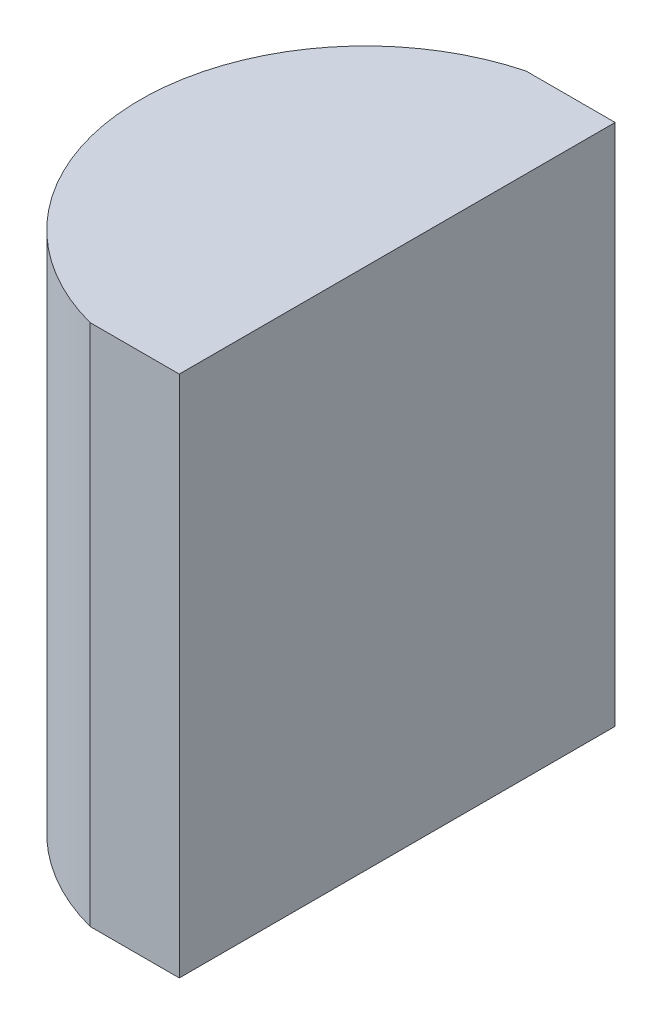
ISO-10303-21;
HEADER;
FILE_DESCRIPTION(('STEP AP214'),'2;1');
FILE_NAME('part.step','',(''),(''),'','','');
FILE_SCHEMA(('AUTOMOTIVE_DESIGN { 1 0 10303 214 1 1 1 1 }'));
ENDSEC;
DATA;
#1=APPLICATION_CONTEXT('core data for automotive mechanical design processes');
#2=APPLICATION_PROTOCOL_DEFINITION('international standard','automotive_design',2000,#1);
#3=PRODUCT_CONTEXT('',#1,'mechanical');
#4=PRODUCT('Part','Part','',(#3));
#5=PRODUCT_RELATED_PRODUCT_CATEGORY('part','',(#4));
#6=PRODUCT_DEFINITION_FORMATION('','',#4);
#7=PRODUCT_DEFINITION_CONTEXT('part definition',#1,'design');
#8=PRODUCT_DEFINITION('design','',#6,#7);
#9=PRODUCT_DEFINITION_SHAPE('','',#8);
#10=(LENGTH_UNIT() NAMED_UNIT(*) SI_UNIT(.MILLI.,.METRE.));
#11=(NAMED_UNIT(*) PLANE_ANGLE_UNIT() SI_UNIT($,.RADIAN.));
#12=(NAMED_UNIT(*) SI_UNIT($,.STERADIAN.) SOLID_ANGLE_UNIT());
#13=UNCERTAINTY_MEASURE_WITH_UNIT(LENGTH_MEASURE(1.E-05),#10,'distance_accuracy_value','');
#14=(GEOMETRIC_REPRESENTATION_CONTEXT(3) GLOBAL_UNCERTAINTY_ASSIGNED_CONTEXT((#13)) GLOBAL_UNIT_ASSIGNED_CONTEXT((#10,
#11,#12)) REPRESENTATION_CONTEXT('',''));
#15=CARTESIAN_POINT('',(0.,0.,0.));
#16=DIRECTION('',(0.,0.,1.));
#17=DIRECTION('',(1.,0.,0.));
#18=AXIS2_PLACEMENT_3D('',#15,#16,#17);
#19=CARTESIAN_POINT('',(4.35520433485127,12.,0.));
#20=DIRECTION('',(0.,-1.,0.));
#21=DIRECTION('',(0.,0.,-1.));
#22=AXIS2_PLACEMENT_3D('',#19,#20,#21);
#23=CYLINDRICAL_SURFACE('',#22,5.17);
#24=CARTESIAN_POINT('',(4.35520433485127,0.,0.));
#25=DIRECTION('',(0.,1.,0.));
#26=DIRECTION('',(0.,0.,1.));
#27=AXIS2_PLACEMENT_3D('',#24,#25,#26);
#28=CIRCLE('',#27,5.17);
#29=CARTESIAN_POINT('',(3.0403279148026,0.,-5.));
#30=VERTEX_POINT('',#29);
#31=CARTESIAN_POINT('',(3.0403279148026,0.,5.));
#32=VERTEX_POINT('',#31);
#33=EDGE_CURVE('E100',#30,#32,#28,.T.);
#34=ORIENTED_EDGE('',*,*,#33,.T.);
#35=DIRECTION('',(0.,-1.,0.));
#36=VECTOR('',#35,1.);
#37=CARTESIAN_POINT('',(3.0403279148026,12.,5.));
#38=LINE('',#37,#36);
#39=CARTESIAN_POINT('',(3.0403279148026,12.,5.));
#40=VERTEX_POINT('',#39);
#41=EDGE_CURVE('E11',#40,#32,#38,.T.);
#42=ORIENTED_EDGE('',*,*,#41,.F.);
#43=CARTESIAN_POINT('',(4.35520433485127,12.,0.));
#44=DIRECTION('',(0.,1.,0.));
#45=DIRECTION('',(0.,0.,1.));
#46=AXIS2_PLACEMENT_3D('',#43,#44,#45);
#47=CIRCLE('',#46,5.17);
#48=CARTESIAN_POINT('',(3.0403279148026,12.,-5.));
#49=VERTEX_POINT('',#48);
#50=EDGE_CURVE('E88',#49,#40,#47,.T.);
#51=ORIENTED_EDGE('',*,*,#50,.F.);
#52=DIRECTION('',(0.,-1.,0.));
#53=VECTOR('',#52,1.);
#54=CARTESIAN_POINT('',(3.0403279148026,12.,-5.));
#55=LINE('',#54,#53);
#56=EDGE_CURVE('E96',#49,#30,#55,.T.);
#57=ORIENTED_EDGE('',*,*,#56,.T.);
#58=EDGE_LOOP('',(#34,#42,#51,#57));
#59=FACE_BOUND('',#58,.T.);
#60=ADVANCED_FACE('F37',(#59),#23,.T.);
#61=CARTESIAN_POINT('',(3.0403279148026,12.,5.));
#62=DIRECTION('',(0.,0.,-1.));
#63=DIRECTION('',(-1.,0.,0.));
#64=AXIS2_PLACEMENT_3D('',#61,#62,#63);
#65=PLANE('',#64);
#66=DIRECTION('',(1.,0.,0.));
#67=VECTOR('',#66,1.);
#68=CARTESIAN_POINT('',(3.0403279148026,0.,5.));
#69=LINE('',#68,#67);
#70=CARTESIAN_POINT('',(5.08520433485127,0.,5.));
#71=VERTEX_POINT('',#70);
#72=EDGE_CURVE('E92',#32,#71,#69,.T.);
#73=ORIENTED_EDGE('',*,*,#72,.T.);
#74=DIRECTION('',(0.,-1.,0.));
#75=VECTOR('',#74,1.);
#76=CARTESIAN_POINT('',(5.08520433485127,12.,5.));
#77=LINE('',#76,#75);
#78=CARTESIAN_POINT('',(5.08520433485127,12.,5.));
#79=VERTEX_POINT('',#78);
#80=EDGE_CURVE('E45',#79,#71,#77,.T.);
#81=ORIENTED_EDGE('',*,*,#80,.F.);
#82=DIRECTION('',(1.,0.,0.));
#83=VECTOR('',#82,1.);
#84=CARTESIAN_POINT('',(3.0403279148026,12.,5.));
#85=LINE('',#84,#83);
#86=EDGE_CURVE('E83',#40,#79,#85,.T.);
#87=ORIENTED_EDGE('',*,*,#86,.F.);
#88=ORIENTED_EDGE('',*,*,#41,.T.);
#89=EDGE_LOOP('',(#73,#81,#87,#88));
#90=FACE_BOUND('',#89,.T.);
#91=ADVANCED_FACE('F91',(#90),#65,.F.);
#92=CARTESIAN_POINT('',(5.08520433485126,12.,-5.));
#93=DIRECTION('',(-1.,0.,0.));
#94=DIRECTION('',(0.,0.,1.));
#95=AXIS2_PLACEMENT_3D('',#92,#93,#94);
#96=PLANE('',#95);
#97=DIRECTION('',(0.,0.,-1.));
#98=VECTOR('',#97,1.);
#99=CARTESIAN_POINT('',(5.08520433485126,0.,-5.));
#100=LINE('',#99,#98);
#101=CARTESIAN_POINT('',(5.08520433485126,0.,-5.));
#102=VERTEX_POINT('',#101);
#103=EDGE_CURVE('E70',#71,#102,#100,.T.);
#104=ORIENTED_EDGE('',*,*,#103,.T.);
#105=DIRECTION('',(0.,-1.,0.));
#106=VECTOR('',#105,1.);
#107=CARTESIAN_POINT('',(5.08520433485126,12.,-5.));
#108=LINE('',#107,#106);
#109=CARTESIAN_POINT('',(5.08520433485126,12.,-5.));
#110=VERTEX_POINT('',#109);
#111=EDGE_CURVE('E93',#110,#102,#108,.T.);
#112=ORIENTED_EDGE('',*,*,#111,.F.);
#113=DIRECTION('',(0.,0.,-1.));
#114=VECTOR('',#113,1.);
#115=CARTESIAN_POINT('',(5.08520433485126,12.,-5.));
#116=LINE('',#115,#114);
#117=EDGE_CURVE('E86',#79,#110,#116,.T.);
#118=ORIENTED_EDGE('',*,*,#117,.F.);
#119=ORIENTED_EDGE('',*,*,#80,.T.);
#120=EDGE_LOOP('',(#104,#112,#118,#119));
#121=FACE_BOUND('',#120,.T.);
#122=ADVANCED_FACE('F94',(#121),#96,.F.);
#123=CARTESIAN_POINT('',(3.0403279148026,12.,-5.));
#124=DIRECTION('',(0.,0.,1.));
#125=DIRECTION('',(1.,0.,0.));
#126=AXIS2_PLACEMENT_3D('',#123,#124,#125);
#127=PLANE('',#126);
#128=DIRECTION('',(-1.,0.,0.));
#129=VECTOR('',#128,1.);
#130=CARTESIAN_POINT('',(3.0403279148026,0.,-5.));
#131=LINE('',#130,#129);
#132=EDGE_CURVE('E76',#102,#30,#131,.T.);
#133=ORIENTED_EDGE('',*,*,#132,.T.);
#134=ORIENTED_EDGE('',*,*,#56,.F.);
#135=DIRECTION('',(-1.,0.,0.));
#136=VECTOR('',#135,1.);
#137=CARTESIAN_POINT('',(3.0403279148026,12.,-5.));
#138=LINE('',#137,#136);
#139=EDGE_CURVE('E53',#110,#49,#138,.T.);
#140=ORIENTED_EDGE('',*,*,#139,.F.);
#141=ORIENTED_EDGE('',*,*,#111,.T.);
#142=EDGE_LOOP('',(#133,#134,#140,#141));
#143=FACE_BOUND('',#142,.T.);
#144=ADVANCED_FACE('F107',(#143),#127,.F.);
#145=CARTESIAN_POINT('',(4.35520433485127,12.,0.));
#146=DIRECTION('',(0.,1.,0.));
#147=DIRECTION('',(0.,0.,1.));
#148=AXIS2_PLACEMENT_3D('',#145,#146,#147);
#149=PLANE('',#148);
#150=ORIENTED_EDGE('',*,*,#50,.T.);
#151=ORIENTED_EDGE('',*,*,#86,.T.);
#152=ORIENTED_EDGE('',*,*,#117,.T.);
#153=ORIENTED_EDGE('',*,*,#139,.T.);
#154=EDGE_LOOP('',(#150,#151,#152,#153));
#155=FACE_BOUND('',#154,.T.);
#156=ADVANCED_FACE('F84',(#155),#149,.T.);
#157=CARTESIAN_POINT('',(4.35520433485127,0.,0.));
#158=DIRECTION('',(0.,1.,0.));
#159=DIRECTION('',(0.,0.,1.));
#160=AXIS2_PLACEMENT_3D('',#157,#158,#159);
#161=PLANE('',#160);
#162=ORIENTED_EDGE('',*,*,#33,.F.);
#163=ORIENTED_EDGE('',*,*,#132,.F.);
#164=ORIENTED_EDGE('',*,*,#103,.F.);
#165=ORIENTED_EDGE('',*,*,#72,.F.);
#166=EDGE_LOOP('',(#162,#163,#164,#165));
#167=FACE_BOUND('',#166,.T.);
#168=ADVANCED_FACE('F110',(#167),#161,.F.);
#169=CLOSED_SHELL('',(#60,#91,#122,#144,#156,#168));
#170=MANIFOLD_SOLID_BREP('B2',#169);
#171=ADVANCED_BREP_SHAPE_REPRESENTATION('',(#18,#170),#14);
#172=SHAPE_DEFINITION_REPRESENTATION(#9,#171);
ENDSEC;
END-ISO-10303-21;
